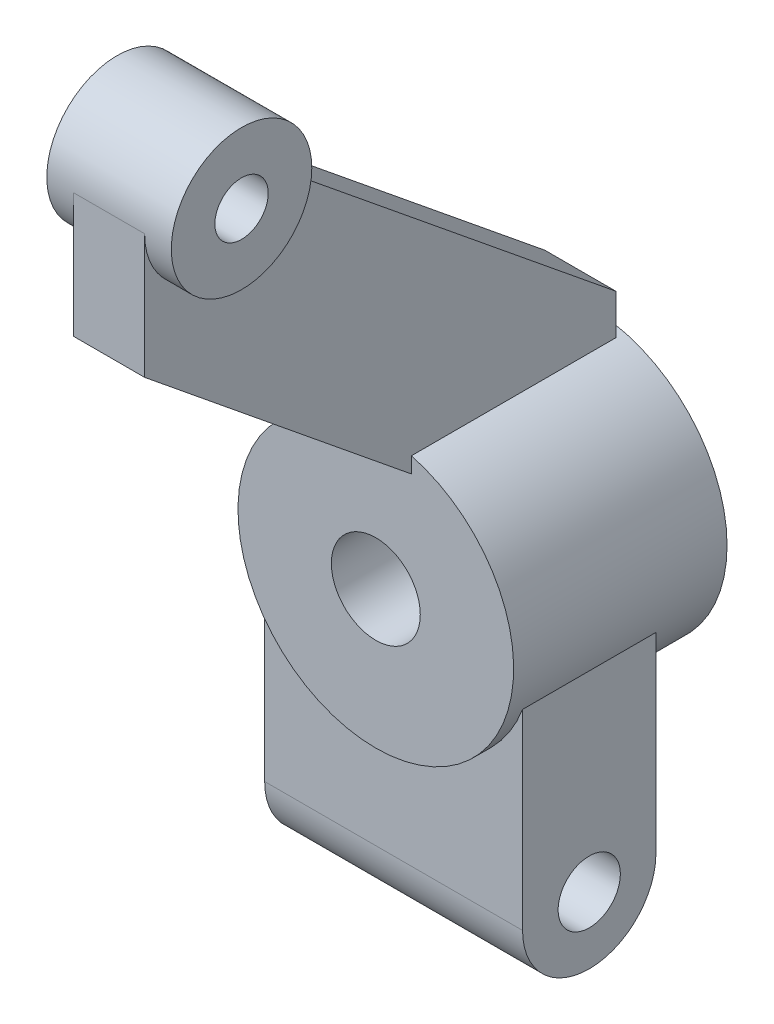
ISO-10303-21;
HEADER;
FILE_DESCRIPTION(('STEP AP214'),'2;1');
FILE_NAME('part.step','',(''),(''),'','','');
FILE_SCHEMA(('AUTOMOTIVE_DESIGN { 1 0 10303 214 1 1 1 1 }'));
ENDSEC;
DATA;
#1=APPLICATION_CONTEXT('core data for automotive mechanical design processes');
#2=APPLICATION_PROTOCOL_DEFINITION('international standard','automotive_design',2000,#1);
#3=PRODUCT_CONTEXT('',#1,'mechanical');
#4=PRODUCT('Part','Part','',(#3));
#5=PRODUCT_RELATED_PRODUCT_CATEGORY('part','',(#4));
#6=PRODUCT_DEFINITION_FORMATION('','',#4);
#7=PRODUCT_DEFINITION_CONTEXT('part definition',#1,'design');
#8=PRODUCT_DEFINITION('design','',#6,#7);
#9=PRODUCT_DEFINITION_SHAPE('','',#8);
#10=(LENGTH_UNIT() NAMED_UNIT(*) SI_UNIT(.MILLI.,.METRE.));
#11=(NAMED_UNIT(*) PLANE_ANGLE_UNIT() SI_UNIT($,.RADIAN.));
#12=(NAMED_UNIT(*) SI_UNIT($,.STERADIAN.) SOLID_ANGLE_UNIT());
#13=UNCERTAINTY_MEASURE_WITH_UNIT(LENGTH_MEASURE(1.E-05),#10,'distance_accuracy_value','');
#14=(GEOMETRIC_REPRESENTATION_CONTEXT(3) GLOBAL_UNCERTAINTY_ASSIGNED_CONTEXT((#13)) GLOBAL_UNIT_ASSIGNED_CONTEXT((#10,
#11,#12)) REPRESENTATION_CONTEXT('',''));
#15=CARTESIAN_POINT('',(0.,0.,0.));
#16=DIRECTION('',(0.,0.,1.));
#17=DIRECTION('',(1.,0.,0.));
#18=AXIS2_PLACEMENT_3D('',#15,#16,#17);
#19=CARTESIAN_POINT('',(2.,25.8,23.05));
#20=DIRECTION('',(-1.,0.,0.));
#21=DIRECTION('',(0.,0.,1.));
#22=AXIS2_PLACEMENT_3D('',#19,#20,#21);
#23=PLANE('',#22);
#24=CARTESIAN_POINT('',(2.,25.8,23.05));
#25=DIRECTION('',(-1.,0.,0.));
#26=DIRECTION('',(0.,0.,1.));
#27=AXIS2_PLACEMENT_3D('',#24,#25,#26);
#28=CIRCLE('',#27,3.95);
#29=CARTESIAN_POINT('',(2.,25.8,27.));
#30=VERTEX_POINT('',#29);
#31=CARTESIAN_POINT('',(2.,24.9568903220212,19.1910278478721));
#32=VERTEX_POINT('',#31);
#33=EDGE_CURVE('E133',#30,#32,#28,.F.);
#34=ORIENTED_EDGE('',*,*,#33,.F.);
#35=DIRECTION('',(0.,-1.,0.));
#36=VECTOR('',#35,1.);
#37=CARTESIAN_POINT('',(2.,18.8053632426681,27.));
#38=LINE('',#37,#36);
#39=CARTESIAN_POINT('',(2.,18.8053632426681,27.));
#40=VERTEX_POINT('',#39);
#41=EDGE_CURVE('E115',#30,#40,#38,.T.);
#42=ORIENTED_EDGE('',*,*,#41,.T.);
#43=DIRECTION('',(0.,-0.631103209350347,-0.775698871436391));
#44=VECTOR('',#43,1.);
#45=CARTESIAN_POINT('',(2.,6.60146751864099,12.));
#46=LINE('',#45,#44);
#47=CARTESIAN_POINT('',(2.,6.60146751864099,12.));
#48=VERTEX_POINT('',#47);
#49=EDGE_CURVE('E148',#40,#48,#46,.T.);
#50=ORIENTED_EDGE('',*,*,#49,.T.);
#51=DIRECTION('',(0.,-1.,0.));
#52=VECTOR('',#51,1.);
#53=CARTESIAN_POINT('',(2.,0.,12.));
#54=LINE('',#53,#52);
#55=CARTESIAN_POINT('',(2.,7.48748956593597,12.));
#56=VERTEX_POINT('',#55);
#57=EDGE_CURVE('E42',#56,#48,#54,.T.);
#58=ORIENTED_EDGE('',*,*,#57,.F.);
#59=DIRECTION('',(0.,0.,-1.));
#60=VECTOR('',#59,1.);
#61=CARTESIAN_POINT('',(2.,7.48748956593597,12.));
#62=LINE('',#61,#60);
#63=CARTESIAN_POINT('',(2.,7.48748956593597,0.500000000000002));
#64=VERTEX_POINT('',#63);
#65=EDGE_CURVE('E167',#56,#64,#62,.T.);
#66=ORIENTED_EDGE('',*,*,#65,.T.);
#67=DIRECTION('',(0.,1.,0.));
#68=VECTOR('',#67,1.);
#69=CARTESIAN_POINT('',(2.,9.75,0.500000000000002));
#70=LINE('',#69,#68);
#71=CARTESIAN_POINT('',(2.,9.75,0.500000000000002));
#72=VERTEX_POINT('',#71);
#73=EDGE_CURVE('E150',#64,#72,#70,.T.);
#74=ORIENTED_EDGE('',*,*,#73,.T.);
#75=DIRECTION('',(0.,0.631103209350347,0.775698871436391));
#76=VECTOR('',#75,1.);
#77=CARTESIAN_POINT('',(2.,24.9568903220212,19.1910278478721));
#78=LINE('',#77,#76);
#79=EDGE_CURVE('E126',#72,#32,#78,.T.);
#80=ORIENTED_EDGE('',*,*,#79,.T.);
#81=EDGE_LOOP('',(#34,#42,#50,#58,#66,#74,#80));
#82=FACE_BOUND('',#81,.T.);
#83=ADVANCED_FACE('F33',(#82),#23,.F.);
#84=CARTESIAN_POINT('',(-2.,25.8,23.05));
#85=DIRECTION('',(-1.,0.,0.));
#86=DIRECTION('',(0.,0.,1.));
#87=AXIS2_PLACEMENT_3D('',#84,#85,#86);
#88=PLANE('',#87);
#89=DIRECTION('',(0.,-1.,0.));
#90=VECTOR('',#89,1.);
#91=CARTESIAN_POINT('',(-2.,18.8053632426681,27.));
#92=LINE('',#91,#90);
#93=CARTESIAN_POINT('',(-2.,25.8,27.));
#94=VERTEX_POINT('',#93);
#95=CARTESIAN_POINT('',(-2.,18.8053632426681,27.));
#96=VERTEX_POINT('',#95);
#97=EDGE_CURVE('E151',#94,#96,#92,.T.);
#98=ORIENTED_EDGE('',*,*,#97,.F.);
#99=CARTESIAN_POINT('',(-2.,25.8,23.05));
#100=DIRECTION('',(-1.,0.,0.));
#101=DIRECTION('',(0.,0.,1.));
#102=AXIS2_PLACEMENT_3D('',#99,#100,#101);
#103=CIRCLE('',#102,3.95);
#104=CARTESIAN_POINT('',(-2.,24.9568903220212,19.1910278478721));
#105=VERTEX_POINT('',#104);
#106=EDGE_CURVE('E134',#94,#105,#103,.F.);
#107=ORIENTED_EDGE('',*,*,#106,.T.);
#108=DIRECTION('',(0.,0.631103209350347,0.775698871436391));
#109=VECTOR('',#108,1.);
#110=CARTESIAN_POINT('',(-2.,24.9568903220212,19.1910278478721));
#111=LINE('',#110,#109);
#112=CARTESIAN_POINT('',(-2.,9.75,0.500000000000002));
#113=VERTEX_POINT('',#112);
#114=EDGE_CURVE('E155',#113,#105,#111,.T.);
#115=ORIENTED_EDGE('',*,*,#114,.F.);
#116=DIRECTION('',(0.,1.,0.));
#117=VECTOR('',#116,1.);
#118=CARTESIAN_POINT('',(-2.,9.75,0.500000000000002));
#119=LINE('',#118,#117);
#120=CARTESIAN_POINT('',(-2.,7.48748956593597,0.500000000000002));
#121=VERTEX_POINT('',#120);
#122=EDGE_CURVE('E142',#121,#113,#119,.T.);
#123=ORIENTED_EDGE('',*,*,#122,.F.);
#124=DIRECTION('',(0.,0.,-1.));
#125=VECTOR('',#124,1.);
#126=CARTESIAN_POINT('',(-2.,7.48748956593597,12.));
#127=LINE('',#126,#125);
#128=CARTESIAN_POINT('',(-2.,7.48748956593597,12.));
#129=VERTEX_POINT('',#128);
#130=EDGE_CURVE('E53',#129,#121,#127,.T.);
#131=ORIENTED_EDGE('',*,*,#130,.F.);
#132=DIRECTION('',(0.,-1.,0.));
#133=VECTOR('',#132,1.);
#134=CARTESIAN_POINT('',(-2.,0.,12.));
#135=LINE('',#134,#133);
#136=CARTESIAN_POINT('',(-2.,6.60146751864099,12.));
#137=VERTEX_POINT('',#136);
#138=EDGE_CURVE('E205',#129,#137,#135,.T.);
#139=ORIENTED_EDGE('',*,*,#138,.T.);
#140=DIRECTION('',(0.,-0.631103209350347,-0.775698871436391));
#141=VECTOR('',#140,1.);
#142=CARTESIAN_POINT('',(-2.,6.60146751864099,12.));
#143=LINE('',#142,#141);
#144=EDGE_CURVE('E139',#96,#137,#143,.T.);
#145=ORIENTED_EDGE('',*,*,#144,.F.);
#146=EDGE_LOOP('',(#98,#107,#115,#123,#131,#139,#145));
#147=FACE_BOUND('',#146,.T.);
#148=ADVANCED_FACE('F250',(#147),#88,.T.);
#149=CARTESIAN_POINT('',(0.,0.,12.));
#150=DIRECTION('',(0.,0.,-1.));
#151=DIRECTION('',(-1.,0.,0.));
#152=AXIS2_PLACEMENT_3D('',#149,#150,#151);
#153=CYLINDRICAL_SURFACE('',#152,7.75);
#154=DIRECTION('',(0.,0.,-1.));
#155=VECTOR('',#154,1.);
#156=CARTESIAN_POINT('',(7.25,-2.73861278752583,12.));
#157=LINE('',#156,#155);
#158=CARTESIAN_POINT('',(7.25,-2.73861278752583,3.5));
#159=VERTEX_POINT('',#158);
#160=CARTESIAN_POINT('',(7.25,-2.73861278752583,11.));
#161=VERTEX_POINT('',#160);
#162=EDGE_CURVE('E203',#159,#161,#157,.F.);
#163=ORIENTED_EDGE('',*,*,#162,.F.);
#164=CARTESIAN_POINT('',(0.,0.,3.5));
#165=DIRECTION('',(0.,0.,1.));
#166=DIRECTION('',(0.,-1.,0.));
#167=AXIS2_PLACEMENT_3D('',#164,#165,#166);
#168=CIRCLE('',#167,7.75);
#169=CARTESIAN_POINT('',(-7.25,-2.73861278752583,3.5));
#170=VERTEX_POINT('',#169);
#171=EDGE_CURVE('E198',#170,#159,#168,.T.);
#172=ORIENTED_EDGE('',*,*,#171,.F.);
#173=DIRECTION('',(0.,0.,-1.));
#174=VECTOR('',#173,1.);
#175=CARTESIAN_POINT('',(-7.25,-2.73861278752583,12.));
#176=LINE('',#175,#174);
#177=CARTESIAN_POINT('',(-7.25,-2.73861278752583,11.));
#178=VERTEX_POINT('',#177);
#179=EDGE_CURVE('E193',#170,#178,#176,.F.);
#180=ORIENTED_EDGE('',*,*,#179,.T.);
#181=CARTESIAN_POINT('',(0.,0.,11.));
#182=DIRECTION('',(0.,0.,-1.));
#183=DIRECTION('',(0.,1.,0.));
#184=AXIS2_PLACEMENT_3D('',#181,#182,#183);
#185=CIRCLE('',#184,7.75);
#186=EDGE_CURVE('E200',#161,#178,#185,.T.);
#187=ORIENTED_EDGE('',*,*,#186,.F.);
#188=EDGE_LOOP('',(#163,#172,#180,#187));
#189=FACE_BOUND('',#188,.T.);
#190=CARTESIAN_POINT('',(0.,0.,0.));
#191=DIRECTION('',(0.,0.,1.));
#192=DIRECTION('',(1.,0.,0.));
#193=AXIS2_PLACEMENT_3D('',#190,#191,#192);
#194=CIRCLE('',#193,7.75);
#195=CARTESIAN_POINT('',(7.75,0.,0.));
#196=VERTEX_POINT('',#195);
#197=EDGE_CURVE('E189',#196,#196,#194,.T.);
#198=ORIENTED_EDGE('',*,*,#197,.T.);
#199=EDGE_LOOP('',(#198));
#200=FACE_BOUND('',#199,.T.);
#201=ORIENTED_EDGE('',*,*,#65,.F.);
#202=CARTESIAN_POINT('',(0.,0.,12.));
#203=DIRECTION('',(0.,0.,1.));
#204=DIRECTION('',(1.,0.,0.));
#205=AXIS2_PLACEMENT_3D('',#202,#203,#204);
#206=CIRCLE('',#205,7.75);
#207=EDGE_CURVE('E190',#129,#56,#206,.T.);
#208=ORIENTED_EDGE('',*,*,#207,.F.);
#209=ORIENTED_EDGE('',*,*,#130,.T.);
#210=CARTESIAN_POINT('',(0.,0.,0.500000000000002));
#211=DIRECTION('',(0.,0.,1.));
#212=DIRECTION('',(1.,0.,0.));
#213=AXIS2_PLACEMENT_3D('',#210,#211,#212);
#214=CIRCLE('',#213,7.75);
#215=EDGE_CURVE('E11',#64,#121,#214,.T.);
#216=ORIENTED_EDGE('',*,*,#215,.F.);
#217=EDGE_LOOP('',(#201,#208,#209,#216));
#218=FACE_BOUND('',#217,.T.);
#219=ADVANCED_FACE('F35',(#189,#200,#218),#153,.T.);
#220=CARTESIAN_POINT('',(0.,0.,12.));
#221=DIRECTION('',(0.,0.,1.));
#222=DIRECTION('',(1.,0.,0.));
#223=AXIS2_PLACEMENT_3D('',#220,#221,#222);
#224=PLANE('',#223);
#225=CARTESIAN_POINT('',(0.,0.,12.));
#226=DIRECTION('',(0.,0.,1.));
#227=DIRECTION('',(1.,0.,0.));
#228=AXIS2_PLACEMENT_3D('',#225,#226,#227);
#229=CIRCLE('',#228,2.5);
#230=CARTESIAN_POINT('',(2.5,0.,12.));
#231=VERTEX_POINT('',#230);
#232=EDGE_CURVE('E221',#231,#231,#229,.T.);
#233=ORIENTED_EDGE('',*,*,#232,.F.);
#234=EDGE_LOOP('',(#233));
#235=FACE_BOUND('',#234,.T.);
#236=ORIENTED_EDGE('',*,*,#207,.T.);
#237=ORIENTED_EDGE('',*,*,#57,.T.);
#238=DIRECTION('',(-1.,0.,0.));
#239=VECTOR('',#238,1.);
#240=CARTESIAN_POINT('',(2.,6.60146751864099,12.));
#241=LINE('',#240,#239);
#242=EDGE_CURVE('E164',#48,#137,#241,.T.);
#243=ORIENTED_EDGE('',*,*,#242,.T.);
#244=ORIENTED_EDGE('',*,*,#138,.F.);
#245=EDGE_LOOP('',(#236,#237,#243,#244));
#246=FACE_BOUND('',#245,.T.);
#247=ADVANCED_FACE('F292',(#235,#246),#224,.T.);
#248=CARTESIAN_POINT('',(0.,0.,0.));
#249=DIRECTION('',(0.,0.,1.));
#250=DIRECTION('',(1.,0.,0.));
#251=AXIS2_PLACEMENT_3D('',#248,#249,#250);
#252=PLANE('',#251);
#253=CARTESIAN_POINT('',(0.,0.,0.));
#254=DIRECTION('',(0.,0.,-1.));
#255=DIRECTION('',(-1.,0.,0.));
#256=AXIS2_PLACEMENT_3D('',#253,#254,#255);
#257=CIRCLE('',#256,2.5);
#258=CARTESIAN_POINT('',(-2.5,0.,0.));
#259=VERTEX_POINT('',#258);
#260=EDGE_CURVE('E226',#259,#259,#257,.T.);
#261=ORIENTED_EDGE('',*,*,#260,.F.);
#262=EDGE_LOOP('',(#261));
#263=FACE_BOUND('',#262,.T.);
#264=ORIENTED_EDGE('',*,*,#197,.F.);
#265=EDGE_LOOP('',(#264));
#266=FACE_BOUND('',#265,.T.);
#267=ADVANCED_FACE('F276',(#263,#266),#252,.F.);
#268=CARTESIAN_POINT('',(7.25,-13.5,7.25));
#269=DIRECTION('',(-1.,0.,0.));
#270=DIRECTION('',(0.,0.,1.));
#271=AXIS2_PLACEMENT_3D('',#268,#269,#270);
#272=PLANE('',#271);
#273=CARTESIAN_POINT('',(7.25,-13.5,7.25));
#274=DIRECTION('',(1.,0.,0.));
#275=DIRECTION('',(0.,0.,-1.));
#276=AXIS2_PLACEMENT_3D('',#273,#274,#275);
#277=CIRCLE('',#276,1.75);
#278=CARTESIAN_POINT('',(7.25,-13.5,5.5));
#279=VERTEX_POINT('',#278);
#280=EDGE_CURVE('E217',#279,#279,#277,.T.);
#281=ORIENTED_EDGE('',*,*,#280,.F.);
#282=EDGE_LOOP('',(#281));
#283=FACE_BOUND('',#282,.T.);
#284=DIRECTION('',(0.,1.,0.));
#285=VECTOR('',#284,1.);
#286=CARTESIAN_POINT('',(7.25,-2.01389562926302,3.5));
#287=LINE('',#286,#285);
#288=CARTESIAN_POINT('',(7.25,-13.5,3.5));
#289=VERTEX_POINT('',#288);
#290=EDGE_CURVE('E175',#289,#159,#287,.T.);
#291=ORIENTED_EDGE('',*,*,#290,.T.);
#292=ORIENTED_EDGE('',*,*,#162,.T.);
#293=DIRECTION('',(0.,-1.,0.));
#294=VECTOR('',#293,1.);
#295=CARTESIAN_POINT('',(7.25,-2.01389562926302,11.));
#296=LINE('',#295,#294);
#297=CARTESIAN_POINT('',(7.25,-13.5,11.));
#298=VERTEX_POINT('',#297);
#299=EDGE_CURVE('E170',#161,#298,#296,.T.);
#300=ORIENTED_EDGE('',*,*,#299,.T.);
#301=CARTESIAN_POINT('',(7.25,-13.5,7.25));
#302=DIRECTION('',(1.,0.,0.));
#303=DIRECTION('',(0.,0.,1.));
#304=AXIS2_PLACEMENT_3D('',#301,#302,#303);
#305=CIRCLE('',#304,3.75);
#306=EDGE_CURVE('E172',#298,#289,#305,.T.);
#307=ORIENTED_EDGE('',*,*,#306,.T.);
#308=EDGE_LOOP('',(#291,#292,#300,#307));
#309=FACE_BOUND('',#308,.T.);
#310=ADVANCED_FACE('F272',(#283,#309),#272,.F.);
#311=CARTESIAN_POINT('',(-7.25,-13.5,7.25));
#312=DIRECTION('',(-1.,0.,0.));
#313=DIRECTION('',(0.,0.,1.));
#314=AXIS2_PLACEMENT_3D('',#311,#312,#313);
#315=PLANE('',#314);
#316=CARTESIAN_POINT('',(-7.25,-13.5,7.25));
#317=DIRECTION('',(-1.,0.,0.));
#318=DIRECTION('',(0.,0.,1.));
#319=AXIS2_PLACEMENT_3D('',#316,#317,#318);
#320=CIRCLE('',#319,1.75);
#321=CARTESIAN_POINT('',(-7.25,-13.5,9.));
#322=VERTEX_POINT('',#321);
#323=EDGE_CURVE('E37',#322,#322,#320,.T.);
#324=ORIENTED_EDGE('',*,*,#323,.F.);
#325=EDGE_LOOP('',(#324));
#326=FACE_BOUND('',#325,.T.);
#327=ORIENTED_EDGE('',*,*,#179,.F.);
#328=DIRECTION('',(0.,1.,0.));
#329=VECTOR('',#328,1.);
#330=CARTESIAN_POINT('',(-7.25,-2.01389562926302,3.5));
#331=LINE('',#330,#329);
#332=CARTESIAN_POINT('',(-7.25,-13.5,3.5));
#333=VERTEX_POINT('',#332);
#334=EDGE_CURVE('E173',#333,#170,#331,.T.);
#335=ORIENTED_EDGE('',*,*,#334,.F.);
#336=CARTESIAN_POINT('',(-7.25,-13.5,7.25));
#337=DIRECTION('',(1.,0.,0.));
#338=DIRECTION('',(0.,0.,1.));
#339=AXIS2_PLACEMENT_3D('',#336,#337,#338);
#340=CIRCLE('',#339,3.75);
#341=CARTESIAN_POINT('',(-7.25,-13.5,11.));
#342=VERTEX_POINT('',#341);
#343=EDGE_CURVE('E180',#342,#333,#340,.T.);
#344=ORIENTED_EDGE('',*,*,#343,.F.);
#345=DIRECTION('',(0.,-1.,0.));
#346=VECTOR('',#345,1.);
#347=CARTESIAN_POINT('',(-7.25,-2.01389562926302,11.));
#348=LINE('',#347,#346);
#349=EDGE_CURVE('E169',#178,#342,#348,.T.);
#350=ORIENTED_EDGE('',*,*,#349,.F.);
#351=EDGE_LOOP('',(#327,#335,#344,#350));
#352=FACE_BOUND('',#351,.T.);
#353=ADVANCED_FACE('F275',(#326,#352),#315,.T.);
#354=CARTESIAN_POINT('',(7.25,-2.01389562926302,11.));
#355=DIRECTION('',(0.,0.,-1.));
#356=DIRECTION('',(0.,1.,0.));
#357=AXIS2_PLACEMENT_3D('',#354,#355,#356);
#358=PLANE('',#357);
#359=ORIENTED_EDGE('',*,*,#299,.F.);
#360=ORIENTED_EDGE('',*,*,#186,.T.);
#361=ORIENTED_EDGE('',*,*,#349,.T.);
#362=DIRECTION('',(-1.,0.,0.));
#363=VECTOR('',#362,1.);
#364=CARTESIAN_POINT('',(7.25,-13.5,11.));
#365=LINE('',#364,#363);
#366=EDGE_CURVE('E186',#298,#342,#365,.T.);
#367=ORIENTED_EDGE('',*,*,#366,.F.);
#368=EDGE_LOOP('',(#359,#360,#361,#367));
#369=FACE_BOUND('',#368,.T.);
#370=ADVANCED_FACE('F280',(#369),#358,.F.);
#371=CARTESIAN_POINT('',(7.25,-13.5,7.25));
#372=DIRECTION('',(-1.,0.,0.));
#373=DIRECTION('',(0.,0.,1.));
#374=AXIS2_PLACEMENT_3D('',#371,#372,#373);
#375=CYLINDRICAL_SURFACE('',#374,3.75);
#376=ORIENTED_EDGE('',*,*,#343,.T.);
#377=DIRECTION('',(-1.,0.,0.));
#378=VECTOR('',#377,1.);
#379=CARTESIAN_POINT('',(7.25,-13.5,3.5));
#380=LINE('',#379,#378);
#381=EDGE_CURVE('E178',#289,#333,#380,.T.);
#382=ORIENTED_EDGE('',*,*,#381,.F.);
#383=ORIENTED_EDGE('',*,*,#306,.F.);
#384=ORIENTED_EDGE('',*,*,#366,.T.);
#385=EDGE_LOOP('',(#376,#382,#383,#384));
#386=FACE_BOUND('',#385,.T.);
#387=ADVANCED_FACE('F284',(#386),#375,.T.);
#388=CARTESIAN_POINT('',(7.25,-2.01389562926302,3.5));
#389=DIRECTION('',(0.,0.,1.));
#390=DIRECTION('',(0.,-1.,0.));
#391=AXIS2_PLACEMENT_3D('',#388,#389,#390);
#392=PLANE('',#391);
#393=ORIENTED_EDGE('',*,*,#334,.T.);
#394=ORIENTED_EDGE('',*,*,#171,.T.);
#395=ORIENTED_EDGE('',*,*,#290,.F.);
#396=ORIENTED_EDGE('',*,*,#381,.T.);
#397=EDGE_LOOP('',(#393,#394,#395,#396));
#398=FACE_BOUND('',#397,.T.);
#399=ADVANCED_FACE('F270',(#398),#392,.F.);
#400=CARTESIAN_POINT('',(2.,6.60146751864099,12.));
#401=DIRECTION('',(0.,0.775698871436392,-0.631103209350347));
#402=DIRECTION('',(0.,0.631103209350347,0.775698871436392));
#403=AXIS2_PLACEMENT_3D('',#400,#401,#402);
#404=PLANE('',#403);
#405=ORIENTED_EDGE('',*,*,#144,.T.);
#406=ORIENTED_EDGE('',*,*,#242,.F.);
#407=ORIENTED_EDGE('',*,*,#49,.F.);
#408=DIRECTION('',(-1.,0.,0.));
#409=VECTOR('',#408,1.);
#410=CARTESIAN_POINT('',(2.,18.8053632426681,27.));
#411=LINE('',#410,#409);
#412=EDGE_CURVE('E121',#40,#96,#411,.T.);
#413=ORIENTED_EDGE('',*,*,#412,.T.);
#414=EDGE_LOOP('',(#405,#406,#407,#413));
#415=FACE_BOUND('',#414,.T.);
#416=ADVANCED_FACE('F266',(#415),#404,.F.);
#417=CARTESIAN_POINT('',(2.,9.75,0.500000000000002));
#418=DIRECTION('',(0.,0.,1.));
#419=DIRECTION('',(1.,0.,0.));
#420=AXIS2_PLACEMENT_3D('',#417,#418,#419);
#421=PLANE('',#420);
#422=ORIENTED_EDGE('',*,*,#73,.F.);
#423=ORIENTED_EDGE('',*,*,#215,.T.);
#424=ORIENTED_EDGE('',*,*,#122,.T.);
#425=DIRECTION('',(-1.,0.,0.));
#426=VECTOR('',#425,1.);
#427=CARTESIAN_POINT('',(2.,9.75,0.500000000000002));
#428=LINE('',#427,#426);
#429=EDGE_CURVE('E161',#72,#113,#428,.T.);
#430=ORIENTED_EDGE('',*,*,#429,.F.);
#431=EDGE_LOOP('',(#422,#423,#424,#430));
#432=FACE_BOUND('',#431,.T.);
#433=ADVANCED_FACE('F262',(#432),#421,.F.);
#434=CARTESIAN_POINT('',(2.,24.9568903220212,19.1910278478721));
#435=DIRECTION('',(0.,-0.775698871436392,0.631103209350347));
#436=DIRECTION('',(0.,-0.631103209350347,-0.775698871436392));
#437=AXIS2_PLACEMENT_3D('',#434,#435,#436);
#438=PLANE('',#437);
#439=ORIENTED_EDGE('',*,*,#114,.T.);
#440=DIRECTION('',(-1.,0.,0.));
#441=VECTOR('',#440,1.);
#442=CARTESIAN_POINT('',(2.,24.9568903220212,19.1910278478721));
#443=LINE('',#442,#441);
#444=EDGE_CURVE('E135',#32,#105,#443,.T.);
#445=ORIENTED_EDGE('',*,*,#444,.F.);
#446=ORIENTED_EDGE('',*,*,#79,.F.);
#447=ORIENTED_EDGE('',*,*,#429,.T.);
#448=EDGE_LOOP('',(#439,#445,#446,#447));
#449=FACE_BOUND('',#448,.T.);
#450=ADVANCED_FACE('F259',(#449),#438,.F.);
#451=CARTESIAN_POINT('',(2.,25.8,23.05));
#452=DIRECTION('',(-1.,0.,0.));
#453=DIRECTION('',(0.,0.,1.));
#454=AXIS2_PLACEMENT_3D('',#451,#452,#453);
#455=CYLINDRICAL_SURFACE('',#454,3.95);
#456=ORIENTED_EDGE('',*,*,#444,.T.);
#457=ORIENTED_EDGE('',*,*,#106,.F.);
#458=DIRECTION('',(-1.,0.,0.));
#459=VECTOR('',#458,1.);
#460=CARTESIAN_POINT('',(2.,25.8,27.));
#461=LINE('',#460,#459);
#462=EDGE_CURVE('E118',#30,#94,#461,.T.);
#463=ORIENTED_EDGE('',*,*,#462,.F.);
#464=ORIENTED_EDGE('',*,*,#33,.T.);
#465=EDGE_LOOP('',(#456,#457,#463,#464));
#466=FACE_BOUND('',#465,.T.);
#467=CARTESIAN_POINT('',(-3.5,25.8,23.05));
#468=DIRECTION('',(1.,0.,0.));
#469=DIRECTION('',(0.,0.,-1.));
#470=AXIS2_PLACEMENT_3D('',#467,#468,#469);
#471=CIRCLE('',#470,3.95);
#472=CARTESIAN_POINT('',(-3.5,25.8,19.1));
#473=VERTEX_POINT('',#472);
#474=EDGE_CURVE('E214',#473,#473,#471,.T.);
#475=ORIENTED_EDGE('',*,*,#474,.T.);
#476=EDGE_LOOP('',(#475));
#477=FACE_BOUND('',#476,.T.);
#478=CARTESIAN_POINT('',(3.5,25.8,23.05));
#479=DIRECTION('',(1.,0.,0.));
#480=DIRECTION('',(0.,0.,-1.));
#481=AXIS2_PLACEMENT_3D('',#478,#479,#480);
#482=CIRCLE('',#481,3.95);
#483=CARTESIAN_POINT('',(3.5,25.8,19.1));
#484=VERTEX_POINT('',#483);
#485=EDGE_CURVE('E144',#484,#484,#482,.T.);
#486=ORIENTED_EDGE('',*,*,#485,.F.);
#487=EDGE_LOOP('',(#486));
#488=FACE_BOUND('',#487,.T.);
#489=ADVANCED_FACE('F131',(#466,#477,#488),#455,.T.);
#490=CARTESIAN_POINT('',(2.,18.8053632426681,27.));
#491=DIRECTION('',(0.,0.,-1.));
#492=DIRECTION('',(-1.,0.,0.));
#493=AXIS2_PLACEMENT_3D('',#490,#491,#492);
#494=PLANE('',#493);
#495=ORIENTED_EDGE('',*,*,#97,.T.);
#496=ORIENTED_EDGE('',*,*,#412,.F.);
#497=ORIENTED_EDGE('',*,*,#41,.F.);
#498=ORIENTED_EDGE('',*,*,#462,.T.);
#499=EDGE_LOOP('',(#495,#496,#497,#498));
#500=FACE_BOUND('',#499,.T.);
#501=ADVANCED_FACE('F117',(#500),#494,.F.);
#502=CARTESIAN_POINT('',(-3.5,25.8,23.05));
#503=DIRECTION('',(1.,0.,0.));
#504=DIRECTION('',(0.,0.,-1.));
#505=AXIS2_PLACEMENT_3D('',#502,#503,#504);
#506=PLANE('',#505);
#507=CARTESIAN_POINT('',(-3.5,25.8,23.05));
#508=DIRECTION('',(1.,0.,0.));
#509=DIRECTION('',(0.,0.,-1.));
#510=AXIS2_PLACEMENT_3D('',#507,#508,#509);
#511=CIRCLE('',#510,1.5);
#512=CARTESIAN_POINT('',(-3.5,25.8,21.55));
#513=VERTEX_POINT('',#512);
#514=EDGE_CURVE('E210',#513,#513,#511,.T.);
#515=ORIENTED_EDGE('',*,*,#514,.T.);
#516=EDGE_LOOP('',(#515));
#517=FACE_BOUND('',#516,.T.);
#518=ORIENTED_EDGE('',*,*,#474,.F.);
#519=EDGE_LOOP('',(#518));
#520=FACE_BOUND('',#519,.T.);
#521=ADVANCED_FACE('F235',(#517,#520),#506,.F.);
#522=CARTESIAN_POINT('',(3.5,25.8,23.05));
#523=DIRECTION('',(1.,0.,0.));
#524=DIRECTION('',(0.,0.,-1.));
#525=AXIS2_PLACEMENT_3D('',#522,#523,#524);
#526=PLANE('',#525);
#527=CARTESIAN_POINT('',(3.5,25.8,23.05));
#528=DIRECTION('',(1.,0.,0.));
#529=DIRECTION('',(0.,0.,-1.));
#530=AXIS2_PLACEMENT_3D('',#527,#528,#529);
#531=CIRCLE('',#530,1.5);
#532=CARTESIAN_POINT('',(3.5,25.8,21.55));
#533=VERTEX_POINT('',#532);
#534=EDGE_CURVE('E208',#533,#533,#531,.T.);
#535=ORIENTED_EDGE('',*,*,#534,.F.);
#536=EDGE_LOOP('',(#535));
#537=FACE_BOUND('',#536,.T.);
#538=ORIENTED_EDGE('',*,*,#485,.T.);
#539=EDGE_LOOP('',(#538));
#540=FACE_BOUND('',#539,.T.);
#541=ADVANCED_FACE('F237',(#537,#540),#526,.T.);
#542=CARTESIAN_POINT('',(-7.75,25.8,23.05));
#543=DIRECTION('',(1.,0.,0.));
#544=DIRECTION('',(0.,0.,-1.));
#545=AXIS2_PLACEMENT_3D('',#542,#543,#544);
#546=CYLINDRICAL_SURFACE('',#545,1.5);
#547=CARTESIAN_POINT('',(3.5,25.8,21.55));
#548=CARTESIAN_POINT('',(3.42708333333333,25.8,21.55));
#549=CARTESIAN_POINT('',(3.35416666666666,25.8,21.55));
#550=CARTESIAN_POINT('',(3.20833333333333,25.8,21.55));
#551=CARTESIAN_POINT('',(3.13541666666666,25.8,21.55));
#552=CARTESIAN_POINT('',(2.98958333333333,25.8,21.55));
#553=CARTESIAN_POINT('',(2.91666666666666,25.8,21.55));
#554=CARTESIAN_POINT('',(2.77083333333333,25.8,21.55));
#555=CARTESIAN_POINT('',(2.69791666666666,25.8,21.55));
#556=CARTESIAN_POINT('',(2.55208333333333,25.8,21.55));
#557=CARTESIAN_POINT('',(2.47916666666666,25.8,21.55));
#558=CARTESIAN_POINT('',(2.33333333333333,25.8,21.55));
#559=CARTESIAN_POINT('',(2.26041666666667,25.8,21.55));
#560=CARTESIAN_POINT('',(2.11458333333333,25.8,21.55));
#561=CARTESIAN_POINT('',(2.04166666666667,25.8,21.55));
#562=CARTESIAN_POINT('',(1.89583333333333,25.8,21.55));
#563=CARTESIAN_POINT('',(1.82291666666666,25.8,21.55));
#564=CARTESIAN_POINT('',(1.67708333333333,25.8,21.55));
#565=CARTESIAN_POINT('',(1.60416666666666,25.8,21.55));
#566=CARTESIAN_POINT('',(1.45833333333333,25.8,21.55));
#567=CARTESIAN_POINT('',(1.38541666666666,25.8,21.55));
#568=CARTESIAN_POINT('',(1.23958333333333,25.8,21.55));
#569=CARTESIAN_POINT('',(1.16666666666667,25.8,21.55));
#570=CARTESIAN_POINT('',(1.02083333333333,25.8,21.55));
#571=CARTESIAN_POINT('',(0.947916666666666,25.8,21.55));
#572=CARTESIAN_POINT('',(0.802083333333332,25.8,21.55));
#573=CARTESIAN_POINT('',(0.729166666666666,25.8,21.55));
#574=CARTESIAN_POINT('',(0.583333333333332,25.8,21.55));
#575=CARTESIAN_POINT('',(0.510416666666665,25.8,21.55));
#576=CARTESIAN_POINT('',(0.364583333333332,25.8,21.55));
#577=CARTESIAN_POINT('',(0.291666666666665,25.8,21.55));
#578=CARTESIAN_POINT('',(0.145833333333332,25.8,21.55));
#579=CARTESIAN_POINT('',(0.0729166666666656,25.8,21.55));
#580=CARTESIAN_POINT('',(-0.0729166666666676,25.8,21.55));
#581=CARTESIAN_POINT('',(-0.145833333333334,25.8,21.55));
#582=CARTESIAN_POINT('',(-0.291666666666668,25.8,21.55));
#583=CARTESIAN_POINT('',(-0.364583333333335,25.8,21.55));
#584=CARTESIAN_POINT('',(-0.510416666666668,25.8,21.55));
#585=CARTESIAN_POINT('',(-0.583333333333334,25.8,21.55));
#586=CARTESIAN_POINT('',(-0.729166666666667,25.8,21.55));
#587=CARTESIAN_POINT('',(-0.802083333333334,25.8,21.55));
#588=CARTESIAN_POINT('',(-0.947916666666668,25.8,21.55));
#589=CARTESIAN_POINT('',(-1.02083333333333,25.8,21.55));
#590=CARTESIAN_POINT('',(-1.16666666666667,25.8,21.55));
#591=CARTESIAN_POINT('',(-1.23958333333333,25.8,21.55));
#592=CARTESIAN_POINT('',(-1.38541666666667,25.8,21.55));
#593=CARTESIAN_POINT('',(-1.45833333333333,25.8,21.55));
#594=CARTESIAN_POINT('',(-1.60416666666667,25.8,21.55));
#595=CARTESIAN_POINT('',(-1.67708333333333,25.8,21.55));
#596=CARTESIAN_POINT('',(-1.82291666666667,25.8,21.55));
#597=CARTESIAN_POINT('',(-1.89583333333333,25.8,21.55));
#598=CARTESIAN_POINT('',(-2.04166666666667,25.8,21.55));
#599=CARTESIAN_POINT('',(-2.11458333333333,25.8,21.55));
#600=CARTESIAN_POINT('',(-2.26041666666667,25.8,21.55));
#601=CARTESIAN_POINT('',(-2.33333333333333,25.8,21.55));
#602=CARTESIAN_POINT('',(-2.47916666666667,25.8,21.55));
#603=CARTESIAN_POINT('',(-2.55208333333333,25.8,21.55));
#604=CARTESIAN_POINT('',(-2.69791666666667,25.8,21.55));
#605=CARTESIAN_POINT('',(-2.77083333333333,25.8,21.55));
#606=CARTESIAN_POINT('',(-2.91666666666667,25.8,21.55));
#607=CARTESIAN_POINT('',(-2.98958333333333,25.8,21.55));
#608=CARTESIAN_POINT('',(-3.13541666666667,25.8,21.55));
#609=CARTESIAN_POINT('',(-3.20833333333333,25.8,21.55));
#610=CARTESIAN_POINT('',(-3.35416666666667,25.8,21.55));
#611=CARTESIAN_POINT('',(-3.42708333333333,25.8,21.55));
#612=CARTESIAN_POINT('',(-3.5,25.8,21.55));
#613=B_SPLINE_CURVE_WITH_KNOTS('',3,(#547,#548,#549,#550,#551,#552,#553,#554,#555,#556,#557,
#558,#559,#560,#561,#562,#563,#564,#565,#566,#567,#568,#569,#570,#571,#572,#573,#574,#575,#576,
#577,#578,#579,#580,#581,#582,#583,#584,#585,#586,#587,#588,#589,#590,#591,#592,#593,#594,#595,
#596,#597,#598,#599,#600,#601,#602,#603,#604,#605,#606,#607,#608,#609,#610,#611,#612),
.UNSPECIFIED.,.F.,.F.,(4,2,2,2,2,2,2,2,2,2,2,2,2,2,2,2,2,2,2,2,2,2,2,2,2,2,2,2,2,2,2,2,4),(0.,
0.21875,0.4375,0.656250000000001,0.875000000000001,1.09375,1.3125,1.53125,1.75,1.96875,2.1875,
2.40625,2.625,2.84375,3.0625,3.28125,3.5,3.71875,3.9375,4.15625,4.375,4.59375,4.8125,5.03125,
5.25,5.46875,5.6875,5.90625,6.125,6.34375,6.5625,6.78125,7.),.UNSPECIFIED.);
#614=EDGE_CURVE('BSEAM244',#533,#513,#613,.T.);
#615=ORIENTED_EDGE('',*,*,#534,.T.);
#616=ORIENTED_EDGE('',*,*,#514,.F.);
#617=ORIENTED_EDGE('',*,*,#614,.T.);
#618=ORIENTED_EDGE('',*,*,#614,.F.);
#619=EDGE_LOOP('',(#615,#617,#616,#618));
#620=FACE_BOUND('',#619,.T.);
#621=ADVANCED_FACE('F244',(#620),#546,.F.);
#622=CARTESIAN_POINT('',(-7.75,-13.5,7.25));
#623=DIRECTION('',(1.,0.,0.));
#624=DIRECTION('',(0.,0.,-1.));
#625=AXIS2_PLACEMENT_3D('',#622,#623,#624);
#626=CYLINDRICAL_SURFACE('',#625,1.75);
#627=ORIENTED_EDGE('',*,*,#323,.T.);
#628=EDGE_LOOP('',(#627));
#629=FACE_BOUND('',#628,.T.);
#630=ORIENTED_EDGE('',*,*,#280,.T.);
#631=EDGE_LOOP('',(#630));
#632=FACE_BOUND('',#631,.T.);
#633=ADVANCED_FACE('F342',(#629,#632),#626,.F.);
#634=CARTESIAN_POINT('',(0.,0.,27.));
#635=DIRECTION('',(0.,0.,-1.));
#636=DIRECTION('',(-1.,0.,0.));
#637=AXIS2_PLACEMENT_3D('',#634,#635,#636);
#638=CYLINDRICAL_SURFACE('',#637,2.5);
#639=ORIENTED_EDGE('',*,*,#232,.T.);
#640=EDGE_LOOP('',(#639));
#641=FACE_BOUND('',#640,.T.);
#642=ORIENTED_EDGE('',*,*,#260,.T.);
#643=EDGE_LOOP('',(#642));
#644=FACE_BOUND('',#643,.T.);
#645=ADVANCED_FACE('F353',(#641,#644),#638,.F.);
#646=CLOSED_SHELL('',(#83,#148,#219,#247,#267,#310,#353,#370,#387,#399,#416,#433,#450,#489,#501,
#521,#541,#621,#633,#645));
#647=MANIFOLD_SOLID_BREP('B2',#646);
#648=ADVANCED_BREP_SHAPE_REPRESENTATION('',(#18,#647),#14);
#649=SHAPE_DEFINITION_REPRESENTATION(#9,#648);
ENDSEC;
END-ISO-10303-21;
